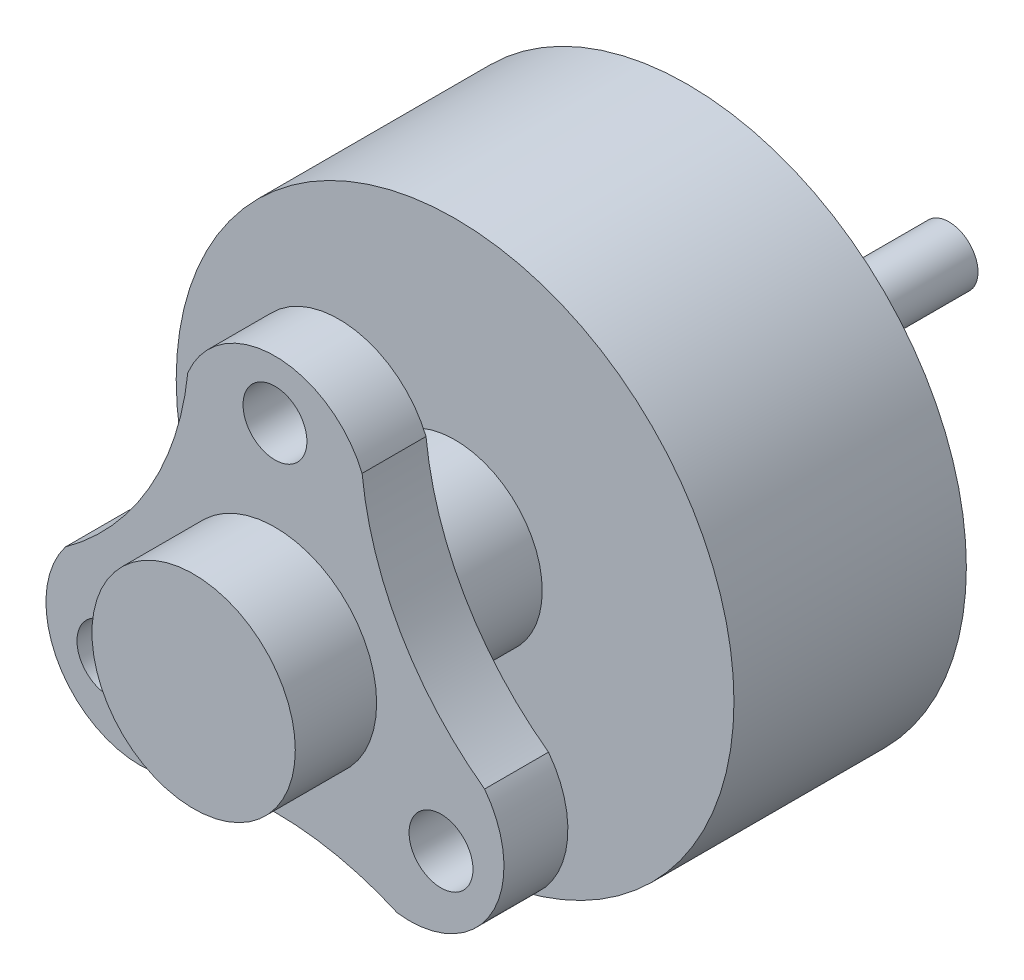
ISO-10303-21;
HEADER;
FILE_DESCRIPTION(('STEP AP214'),'2;1');
FILE_NAME('part.step','',(''),(''),'','','');
FILE_SCHEMA(('AUTOMOTIVE_DESIGN { 1 0 10303 214 1 1 1 1 }'));
ENDSEC;
DATA;
#1=APPLICATION_CONTEXT('core data for automotive mechanical design processes');
#2=APPLICATION_PROTOCOL_DEFINITION('international standard','automotive_design',2000,#1);
#3=PRODUCT_CONTEXT('',#1,'mechanical');
#4=PRODUCT('Part','Part','',(#3));
#5=PRODUCT_RELATED_PRODUCT_CATEGORY('part','',(#4));
#6=PRODUCT_DEFINITION_FORMATION('','',#4);
#7=PRODUCT_DEFINITION_CONTEXT('part definition',#1,'design');
#8=PRODUCT_DEFINITION('design','',#6,#7);
#9=PRODUCT_DEFINITION_SHAPE('','',#8);
#10=(LENGTH_UNIT() NAMED_UNIT(*) SI_UNIT(.MILLI.,.METRE.));
#11=(NAMED_UNIT(*) PLANE_ANGLE_UNIT() SI_UNIT($,.RADIAN.));
#12=(NAMED_UNIT(*) SI_UNIT($,.STERADIAN.) SOLID_ANGLE_UNIT());
#13=UNCERTAINTY_MEASURE_WITH_UNIT(LENGTH_MEASURE(1.E-05),#10,'distance_accuracy_value','');
#14=(GEOMETRIC_REPRESENTATION_CONTEXT(3) GLOBAL_UNCERTAINTY_ASSIGNED_CONTEXT((#13)) GLOBAL_UNIT_ASSIGNED_CONTEXT((#10,
#11,#12)) REPRESENTATION_CONTEXT('',''));
#15=CARTESIAN_POINT('',(0.,0.,0.));
#16=DIRECTION('',(0.,0.,1.));
#17=DIRECTION('',(1.,0.,0.));
#18=AXIS2_PLACEMENT_3D('',#15,#16,#17);
#19=CARTESIAN_POINT('',(0.,0.,4.));
#20=DIRECTION('',(0.,0.,-1.));
#21=DIRECTION('',(-1.,0.,0.));
#22=AXIS2_PLACEMENT_3D('',#19,#20,#21);
#23=CYLINDRICAL_SURFACE('',#22,4.8);
#24=CARTESIAN_POINT('',(0.,0.,4.));
#25=DIRECTION('',(0.,0.,1.));
#26=DIRECTION('',(1.,0.,0.));
#27=AXIS2_PLACEMENT_3D('',#24,#25,#26);
#28=CIRCLE('',#27,4.8);
#29=CARTESIAN_POINT('',(4.8,0.,4.));
#30=VERTEX_POINT('',#29);
#31=EDGE_CURVE('E174',#30,#30,#28,.T.);
#32=ORIENTED_EDGE('',*,*,#31,.F.);
#33=EDGE_LOOP('',(#32));
#34=FACE_BOUND('',#33,.T.);
#35=CARTESIAN_POINT('',(0.,0.,0.));
#36=DIRECTION('',(0.,0.,1.));
#37=DIRECTION('',(1.,0.,0.));
#38=AXIS2_PLACEMENT_3D('',#35,#36,#37);
#39=CIRCLE('',#38,4.8);
#40=CARTESIAN_POINT('',(4.8,0.,0.));
#41=VERTEX_POINT('',#40);
#42=EDGE_CURVE('E170',#41,#41,#39,.T.);
#43=ORIENTED_EDGE('',*,*,#42,.T.);
#44=EDGE_LOOP('',(#43));
#45=FACE_BOUND('',#44,.T.);
#46=ADVANCED_FACE('F45',(#34,#45),#23,.T.);
#47=CARTESIAN_POINT('',(0.,0.,4.));
#48=DIRECTION('',(0.,0.,1.));
#49=DIRECTION('',(1.,0.,0.));
#50=AXIS2_PLACEMENT_3D('',#47,#48,#49);
#51=PLANE('',#50);
#52=CARTESIAN_POINT('',(0.,0.,4.));
#53=DIRECTION('',(0.,0.,1.));
#54=DIRECTION('',(1.,0.,0.));
#55=AXIS2_PLACEMENT_3D('',#52,#53,#54);
#56=CIRCLE('',#55,1.5);
#57=CARTESIAN_POINT('',(1.5,0.,4.));
#58=VERTEX_POINT('',#57);
#59=EDGE_CURVE('E54',#58,#58,#56,.T.);
#60=ORIENTED_EDGE('',*,*,#59,.F.);
#61=EDGE_LOOP('',(#60));
#62=FACE_BOUND('',#61,.T.);
#63=ORIENTED_EDGE('',*,*,#31,.T.);
#64=EDGE_LOOP('',(#63));
#65=FACE_BOUND('',#64,.T.);
#66=ADVANCED_FACE('F185',(#62,#65),#51,.T.);
#67=CARTESIAN_POINT('',(0.,0.,0.));
#68=DIRECTION('',(0.,0.,1.));
#69=DIRECTION('',(1.,0.,0.));
#70=AXIS2_PLACEMENT_3D('',#67,#68,#69);
#71=PLANE('',#70);
#72=CARTESIAN_POINT('',(0.,0.,0.));
#73=DIRECTION('',(0.,0.,1.));
#74=DIRECTION('',(1.,0.,0.));
#75=AXIS2_PLACEMENT_3D('',#72,#73,#74);
#76=CIRCLE('',#75,0.5);
#77=CARTESIAN_POINT('',(0.5,0.,0.));
#78=VERTEX_POINT('',#77);
#79=EDGE_CURVE('E11',#78,#78,#76,.F.);
#80=ORIENTED_EDGE('',*,*,#79,.F.);
#81=EDGE_LOOP('',(#80));
#82=FACE_BOUND('',#81,.T.);
#83=ORIENTED_EDGE('',*,*,#42,.F.);
#84=EDGE_LOOP('',(#83));
#85=FACE_BOUND('',#84,.T.);
#86=ADVANCED_FACE('F182',(#82,#85),#71,.F.);
#87=CARTESIAN_POINT('',(0.,0.,6.));
#88=DIRECTION('',(0.,0.,-1.));
#89=DIRECTION('',(-1.,0.,0.));
#90=AXIS2_PLACEMENT_3D('',#87,#88,#89);
#91=CYLINDRICAL_SURFACE('',#90,1.5);
#92=CARTESIAN_POINT('',(0.,0.,6.));
#93=DIRECTION('',(0.,0.,1.));
#94=DIRECTION('',(1.,0.,0.));
#95=AXIS2_PLACEMENT_3D('',#92,#93,#94);
#96=CIRCLE('',#95,1.5);
#97=CARTESIAN_POINT('',(1.5,0.,6.));
#98=VERTEX_POINT('',#97);
#99=EDGE_CURVE('E166',#98,#98,#96,.T.);
#100=ORIENTED_EDGE('',*,*,#99,.F.);
#101=EDGE_LOOP('',(#100));
#102=FACE_BOUND('',#101,.T.);
#103=ORIENTED_EDGE('',*,*,#59,.T.);
#104=EDGE_LOOP('',(#103));
#105=FACE_BOUND('',#104,.T.);
#106=ADVANCED_FACE('F184',(#102,#105),#91,.T.);
#107=CARTESIAN_POINT('',(-2.31661795512337,-1.33750000000001,7.1));
#108=DIRECTION('',(0.,0.,-1.));
#109=DIRECTION('',(-1.,0.,0.));
#110=AXIS2_PLACEMENT_3D('',#107,#108,#109);
#111=CYLINDRICAL_SURFACE('',#110,1.625);
#112=CARTESIAN_POINT('',(-2.31661795512337,-1.33750000000001,6.));
#113=DIRECTION('',(0.,0.,1.));
#114=DIRECTION('',(1.,0.,0.));
#115=AXIS2_PLACEMENT_3D('',#112,#113,#114);
#116=CIRCLE('',#115,1.625);
#117=CARTESIAN_POINT('',(-3.60788383248865,-0.35096189432336,6.));
#118=VERTEX_POINT('',#117);
#119=CARTESIAN_POINT('',(-2.10788383248863,-2.94903810567667,6.));
#120=VERTEX_POINT('',#119);
#121=EDGE_CURVE('E133',#118,#120,#116,.T.);
#122=ORIENTED_EDGE('',*,*,#121,.T.);
#123=DIRECTION('',(0.,0.,-1.));
#124=VECTOR('',#123,1.);
#125=CARTESIAN_POINT('',(-2.10788383248863,-2.94903810567667,7.1));
#126=LINE('',#125,#124);
#127=CARTESIAN_POINT('',(-2.10788383248863,-2.94903810567667,7.1));
#128=VERTEX_POINT('',#127);
#129=EDGE_CURVE('E163',#128,#120,#126,.T.);
#130=ORIENTED_EDGE('',*,*,#129,.F.);
#131=CARTESIAN_POINT('',(-2.31661795512337,-1.33750000000001,7.1));
#132=DIRECTION('',(0.,0.,1.));
#133=DIRECTION('',(1.,0.,0.));
#134=AXIS2_PLACEMENT_3D('',#131,#132,#133);
#135=CIRCLE('',#134,1.625);
#136=CARTESIAN_POINT('',(-3.60788383248865,-0.35096189432336,7.1));
#137=VERTEX_POINT('',#136);
#138=EDGE_CURVE('E153',#137,#128,#135,.T.);
#139=ORIENTED_EDGE('',*,*,#138,.F.);
#140=DIRECTION('',(0.,0.,-1.));
#141=VECTOR('',#140,1.);
#142=CARTESIAN_POINT('',(-3.60788383248865,-0.35096189432336,7.1));
#143=LINE('',#142,#141);
#144=EDGE_CURVE('E129',#137,#118,#143,.T.);
#145=ORIENTED_EDGE('',*,*,#144,.T.);
#146=EDGE_LOOP('',(#122,#130,#139,#145));
#147=FACE_BOUND('',#146,.T.);
#148=ADVANCED_FACE('F191',(#147),#111,.T.);
#149=CARTESIAN_POINT('',(0.,-7.67195468814085,7.1));
#150=DIRECTION('',(0.,0.,-1.));
#151=DIRECTION('',(-1.,0.,0.));
#152=AXIS2_PLACEMENT_3D('',#149,#150,#151);
#153=CYLINDRICAL_SURFACE('',#152,5.17195468814085);
#154=CARTESIAN_POINT('',(0.,-7.67195468814085,6.));
#155=DIRECTION('',(0.,0.,1.));
#156=DIRECTION('',(1.,0.,0.));
#157=AXIS2_PLACEMENT_3D('',#154,#155,#156);
#158=CIRCLE('',#157,5.17195468814085);
#159=CARTESIAN_POINT('',(2.10788383248864,-2.94903810567667,6.));
#160=VERTEX_POINT('',#159);
#161=EDGE_CURVE('E137',#120,#160,#158,.F.);
#162=ORIENTED_EDGE('',*,*,#161,.T.);
#163=DIRECTION('',(0.,0.,-1.));
#164=VECTOR('',#163,1.);
#165=CARTESIAN_POINT('',(2.10788383248864,-2.94903810567667,7.1));
#166=LINE('',#165,#164);
#167=CARTESIAN_POINT('',(2.10788383248864,-2.94903810567667,7.1));
#168=VERTEX_POINT('',#167);
#169=EDGE_CURVE('E160',#168,#160,#166,.T.);
#170=ORIENTED_EDGE('',*,*,#169,.F.);
#171=CARTESIAN_POINT('',(0.,-7.67195468814085,7.1));
#172=DIRECTION('',(0.,0.,1.));
#173=DIRECTION('',(1.,0.,0.));
#174=AXIS2_PLACEMENT_3D('',#171,#172,#173);
#175=CIRCLE('',#174,5.17195468814085);
#176=EDGE_CURVE('E96',#128,#168,#175,.F.);
#177=ORIENTED_EDGE('',*,*,#176,.F.);
#178=ORIENTED_EDGE('',*,*,#129,.T.);
#179=EDGE_LOOP('',(#162,#170,#177,#178));
#180=FACE_BOUND('',#179,.T.);
#181=ADVANCED_FACE('F225',(#180),#153,.F.);
#182=CARTESIAN_POINT('',(2.31661795512337,-1.33750000000001,7.1));
#183=DIRECTION('',(0.,0.,-1.));
#184=DIRECTION('',(-1.,0.,0.));
#185=AXIS2_PLACEMENT_3D('',#182,#183,#184);
#186=CYLINDRICAL_SURFACE('',#185,1.625);
#187=CARTESIAN_POINT('',(2.31661795512337,-1.33750000000001,6.));
#188=DIRECTION('',(0.,0.,1.));
#189=DIRECTION('',(1.,0.,0.));
#190=AXIS2_PLACEMENT_3D('',#187,#188,#189);
#191=CIRCLE('',#190,1.625);
#192=CARTESIAN_POINT('',(3.60788383248865,-0.350961894323359,6.));
#193=VERTEX_POINT('',#192);
#194=EDGE_CURVE('E142',#193,#160,#191,.F.);
#195=ORIENTED_EDGE('',*,*,#194,.F.);
#196=DIRECTION('',(0.,0.,-1.));
#197=VECTOR('',#196,1.);
#198=CARTESIAN_POINT('',(3.60788383248865,-0.350961894323359,7.1));
#199=LINE('',#198,#197);
#200=CARTESIAN_POINT('',(3.60788383248865,-0.350961894323359,7.1));
#201=VERTEX_POINT('',#200);
#202=EDGE_CURVE('E116',#201,#193,#199,.T.);
#203=ORIENTED_EDGE('',*,*,#202,.F.);
#204=CARTESIAN_POINT('',(2.31661795512337,-1.33750000000001,7.1));
#205=DIRECTION('',(0.,0.,1.));
#206=DIRECTION('',(1.,0.,0.));
#207=AXIS2_PLACEMENT_3D('',#204,#205,#206);
#208=CIRCLE('',#207,1.625);
#209=EDGE_CURVE('E122',#201,#168,#208,.F.);
#210=ORIENTED_EDGE('',*,*,#209,.T.);
#211=ORIENTED_EDGE('',*,*,#169,.T.);
#212=EDGE_LOOP('',(#195,#203,#210,#211));
#213=FACE_BOUND('',#212,.T.);
#214=ADVANCED_FACE('F236',(#213),#186,.T.);
#215=CARTESIAN_POINT('',(6.64410765661333,3.83597734407054,7.1));
#216=DIRECTION('',(0.,0.,-1.));
#217=DIRECTION('',(-1.,0.,0.));
#218=AXIS2_PLACEMENT_3D('',#215,#216,#217);
#219=CYLINDRICAL_SURFACE('',#218,5.17195468814111);
#220=CARTESIAN_POINT('',(6.64410765661333,3.83597734407054,6.));
#221=DIRECTION('',(0.,0.,1.));
#222=DIRECTION('',(1.,0.,0.));
#223=AXIS2_PLACEMENT_3D('',#220,#221,#222);
#224=CIRCLE('',#223,5.17195468814111);
#225=CARTESIAN_POINT('',(1.5,3.3,6.));
#226=VERTEX_POINT('',#225);
#227=EDGE_CURVE('E110',#226,#193,#224,.T.);
#228=ORIENTED_EDGE('',*,*,#227,.F.);
#229=DIRECTION('',(0.,0.,-1.));
#230=VECTOR('',#229,1.);
#231=CARTESIAN_POINT('',(1.5,3.3,7.1));
#232=LINE('',#231,#230);
#233=CARTESIAN_POINT('',(1.5,3.3,7.1));
#234=VERTEX_POINT('',#233);
#235=EDGE_CURVE('E105',#234,#226,#232,.T.);
#236=ORIENTED_EDGE('',*,*,#235,.F.);
#237=CARTESIAN_POINT('',(6.64410765661333,3.83597734407054,7.1));
#238=DIRECTION('',(0.,0.,1.));
#239=DIRECTION('',(1.,0.,0.));
#240=AXIS2_PLACEMENT_3D('',#237,#238,#239);
#241=CIRCLE('',#240,5.17195468814111);
#242=EDGE_CURVE('E108',#234,#201,#241,.T.);
#243=ORIENTED_EDGE('',*,*,#242,.T.);
#244=ORIENTED_EDGE('',*,*,#202,.T.);
#245=EDGE_LOOP('',(#228,#236,#243,#244));
#246=FACE_BOUND('',#245,.T.);
#247=ADVANCED_FACE('F107',(#246),#219,.F.);
#248=CARTESIAN_POINT('',(0.,2.675,7.1));
#249=DIRECTION('',(0.,0.,-1.));
#250=DIRECTION('',(-1.,0.,0.));
#251=AXIS2_PLACEMENT_3D('',#248,#249,#250);
#252=CYLINDRICAL_SURFACE('',#251,1.625);
#253=CARTESIAN_POINT('',(0.,2.675,6.));
#254=DIRECTION('',(0.,0.,1.));
#255=DIRECTION('',(1.,0.,0.));
#256=AXIS2_PLACEMENT_3D('',#253,#254,#255);
#257=CIRCLE('',#256,1.625);
#258=CARTESIAN_POINT('',(-1.5,3.3,6.));
#259=VERTEX_POINT('',#258);
#260=EDGE_CURVE('E148',#259,#226,#257,.F.);
#261=ORIENTED_EDGE('',*,*,#260,.F.);
#262=DIRECTION('',(0.,0.,-1.));
#263=VECTOR('',#262,1.);
#264=CARTESIAN_POINT('',(-1.5,3.3,7.1));
#265=LINE('',#264,#263);
#266=CARTESIAN_POINT('',(-1.5,3.3,7.1));
#267=VERTEX_POINT('',#266);
#268=EDGE_CURVE('E84',#267,#259,#265,.T.);
#269=ORIENTED_EDGE('',*,*,#268,.F.);
#270=CARTESIAN_POINT('',(0.,2.675,7.1));
#271=DIRECTION('',(0.,0.,1.));
#272=DIRECTION('',(1.,0.,0.));
#273=AXIS2_PLACEMENT_3D('',#270,#271,#272);
#274=CIRCLE('',#273,1.625);
#275=EDGE_CURVE('E120',#267,#234,#274,.F.);
#276=ORIENTED_EDGE('',*,*,#275,.T.);
#277=ORIENTED_EDGE('',*,*,#235,.T.);
#278=EDGE_LOOP('',(#261,#269,#276,#277));
#279=FACE_BOUND('',#278,.T.);
#280=ADVANCED_FACE('F125',(#279),#252,.T.);
#281=CARTESIAN_POINT('',(-6.64410765661333,3.83597734407054,7.1));
#282=DIRECTION('',(0.,0.,-1.));
#283=DIRECTION('',(-1.,0.,0.));
#284=AXIS2_PLACEMENT_3D('',#281,#282,#283);
#285=CYLINDRICAL_SURFACE('',#284,5.17195468814111);
#286=CARTESIAN_POINT('',(-6.64410765661333,3.83597734407054,6.));
#287=DIRECTION('',(0.,0.,1.));
#288=DIRECTION('',(1.,0.,0.));
#289=AXIS2_PLACEMENT_3D('',#286,#287,#288);
#290=CIRCLE('',#289,5.17195468814111);
#291=EDGE_CURVE('E87',#259,#118,#290,.F.);
#292=ORIENTED_EDGE('',*,*,#291,.T.);
#293=ORIENTED_EDGE('',*,*,#144,.F.);
#294=CARTESIAN_POINT('',(-6.64410765661333,3.83597734407054,7.1));
#295=DIRECTION('',(0.,0.,1.));
#296=DIRECTION('',(1.,0.,0.));
#297=AXIS2_PLACEMENT_3D('',#294,#295,#296);
#298=CIRCLE('',#297,5.17195468814111);
#299=EDGE_CURVE('E62',#267,#137,#298,.F.);
#300=ORIENTED_EDGE('',*,*,#299,.F.);
#301=ORIENTED_EDGE('',*,*,#268,.T.);
#302=EDGE_LOOP('',(#292,#293,#300,#301));
#303=FACE_BOUND('',#302,.T.);
#304=ADVANCED_FACE('F265',(#303),#285,.F.);
#305=CARTESIAN_POINT('',(0.,0.,7.1));
#306=DIRECTION('',(0.,0.,1.));
#307=DIRECTION('',(1.,0.,0.));
#308=AXIS2_PLACEMENT_3D('',#305,#306,#307);
#309=PLANE('',#308);
#310=CARTESIAN_POINT('',(0.,0.,7.1));
#311=DIRECTION('',(0.,0.,1.));
#312=DIRECTION('',(1.,0.,0.));
#313=AXIS2_PLACEMENT_3D('',#310,#311,#312);
#314=CIRCLE('',#313,1.75);
#315=CARTESIAN_POINT('',(1.75,0.,7.1));
#316=VERTEX_POINT('',#315);
#317=EDGE_CURVE('E474',#316,#316,#314,.T.);
#318=ORIENTED_EDGE('',*,*,#317,.F.);
#319=EDGE_LOOP('',(#318));
#320=FACE_BOUND('',#319,.T.);
#321=CARTESIAN_POINT('',(2.85788415590999,-1.64999984120291,7.1));
#322=DIRECTION('',(0.,0.,1.));
#323=DIRECTION('',(1.,0.,0.));
#324=AXIS2_PLACEMENT_3D('',#321,#322,#323);
#325=CIRCLE('',#324,0.549999999999988);
#326=CARTESIAN_POINT('',(3.40788415590997,-1.64999984120291,7.1));
#327=VERTEX_POINT('',#326);
#328=EDGE_CURVE('E479',#327,#327,#325,.T.);
#329=ORIENTED_EDGE('',*,*,#328,.F.);
#330=EDGE_LOOP('',(#329));
#331=FACE_BOUND('',#330,.T.);
#332=CARTESIAN_POINT('',(-2.85788391023536,-1.64999984120291,7.1));
#333=DIRECTION('',(0.,0.,1.));
#334=DIRECTION('',(1.,0.,0.));
#335=AXIS2_PLACEMENT_3D('',#332,#333,#334);
#336=CIRCLE('',#335,0.549999999999988);
#337=CARTESIAN_POINT('',(-2.30788391023537,-1.64999984120291,7.1));
#338=VERTEX_POINT('',#337);
#339=EDGE_CURVE('E491',#338,#338,#336,.T.);
#340=ORIENTED_EDGE('',*,*,#339,.F.);
#341=EDGE_LOOP('',(#340));
#342=FACE_BOUND('',#341,.T.);
#343=CARTESIAN_POINT('',(0.,3.30000022768105,7.1));
#344=DIRECTION('',(0.,0.,1.));
#345=DIRECTION('',(1.,0.,0.));
#346=AXIS2_PLACEMENT_3D('',#343,#344,#345);
#347=CIRCLE('',#346,0.549999999999988);
#348=CARTESIAN_POINT('',(0.549999999999988,3.30000022768105,7.1));
#349=VERTEX_POINT('',#348);
#350=EDGE_CURVE('E499',#349,#349,#347,.T.);
#351=ORIENTED_EDGE('',*,*,#350,.F.);
#352=EDGE_LOOP('',(#351));
#353=FACE_BOUND('',#352,.T.);
#354=ORIENTED_EDGE('',*,*,#138,.T.);
#355=ORIENTED_EDGE('',*,*,#176,.T.);
#356=ORIENTED_EDGE('',*,*,#209,.F.);
#357=ORIENTED_EDGE('',*,*,#242,.F.);
#358=ORIENTED_EDGE('',*,*,#275,.F.);
#359=ORIENTED_EDGE('',*,*,#299,.T.);
#360=EDGE_LOOP('',(#354,#355,#356,#357,#358,#359));
#361=FACE_BOUND('',#360,.T.);
#362=ADVANCED_FACE('F119',(#320,#331,#342,#353,#361),#309,.T.);
#363=CARTESIAN_POINT('',(0.,0.,6.));
#364=DIRECTION('',(0.,0.,1.));
#365=DIRECTION('',(1.,0.,0.));
#366=AXIS2_PLACEMENT_3D('',#363,#364,#365);
#367=PLANE('',#366);
#368=CARTESIAN_POINT('',(2.85788415590999,-1.64999984120291,6.));
#369=DIRECTION('',(0.,0.,1.));
#370=DIRECTION('',(1.,0.,0.));
#371=AXIS2_PLACEMENT_3D('',#368,#369,#370);
#372=CIRCLE('',#371,0.549999999999994);
#373=CARTESIAN_POINT('',(3.40788415590998,-1.64999984120291,6.));
#374=VERTEX_POINT('',#373);
#375=EDGE_CURVE('E487',#374,#374,#372,.T.);
#376=ORIENTED_EDGE('',*,*,#375,.T.);
#377=EDGE_LOOP('',(#376));
#378=FACE_BOUND('',#377,.T.);
#379=CARTESIAN_POINT('',(-2.85788391023536,-1.64999984120291,6.));
#380=DIRECTION('',(0.,0.,1.));
#381=DIRECTION('',(1.,0.,0.));
#382=AXIS2_PLACEMENT_3D('',#379,#380,#381);
#383=CIRCLE('',#382,0.549999999999994);
#384=CARTESIAN_POINT('',(-2.30788391023537,-1.64999984120291,6.));
#385=VERTEX_POINT('',#384);
#386=EDGE_CURVE('E495',#385,#385,#383,.T.);
#387=ORIENTED_EDGE('',*,*,#386,.T.);
#388=EDGE_LOOP('',(#387));
#389=FACE_BOUND('',#388,.T.);
#390=CARTESIAN_POINT('',(0.,3.30000022768105,6.));
#391=DIRECTION('',(0.,0.,1.));
#392=DIRECTION('',(1.,0.,0.));
#393=AXIS2_PLACEMENT_3D('',#390,#391,#392);
#394=CIRCLE('',#393,0.549999999999994);
#395=CARTESIAN_POINT('',(0.549999999999994,3.30000022768105,6.));
#396=VERTEX_POINT('',#395);
#397=EDGE_CURVE('E138',#396,#396,#394,.T.);
#398=ORIENTED_EDGE('',*,*,#397,.T.);
#399=EDGE_LOOP('',(#398));
#400=FACE_BOUND('',#399,.T.);
#401=ORIENTED_EDGE('',*,*,#99,.T.);
#402=EDGE_LOOP('',(#401));
#403=FACE_BOUND('',#402,.T.);
#404=ORIENTED_EDGE('',*,*,#121,.F.);
#405=ORIENTED_EDGE('',*,*,#291,.F.);
#406=ORIENTED_EDGE('',*,*,#260,.T.);
#407=ORIENTED_EDGE('',*,*,#227,.T.);
#408=ORIENTED_EDGE('',*,*,#194,.T.);
#409=ORIENTED_EDGE('',*,*,#161,.F.);
#410=EDGE_LOOP('',(#404,#405,#406,#407,#408,#409));
#411=FACE_BOUND('',#410,.T.);
#412=ADVANCED_FACE('F282',(#378,#389,#400,#403,#411),#367,.F.);
#413=CARTESIAN_POINT('',(0.,3.30000022768105,7.1));
#414=DIRECTION('',(0.,0.,1.));
#415=DIRECTION('',(1.,0.,0.));
#416=AXIS2_PLACEMENT_3D('',#413,#414,#415);
#417=CYLINDRICAL_SURFACE('',#416,0.549999999999994);
#418=ORIENTED_EDGE('',*,*,#397,.F.);
#419=EDGE_LOOP('',(#418));
#420=FACE_BOUND('',#419,.T.);
#421=ORIENTED_EDGE('',*,*,#350,.T.);
#422=EDGE_LOOP('',(#421));
#423=FACE_BOUND('',#422,.T.);
#424=ADVANCED_FACE('F287',(#420,#423),#417,.F.);
#425=CARTESIAN_POINT('',(-2.85788391023536,-1.64999984120291,7.1));
#426=DIRECTION('',(0.,0.,1.));
#427=DIRECTION('',(1.,0.,0.));
#428=AXIS2_PLACEMENT_3D('',#425,#426,#427);
#429=CYLINDRICAL_SURFACE('',#428,0.549999999999994);
#430=ORIENTED_EDGE('',*,*,#386,.F.);
#431=EDGE_LOOP('',(#430));
#432=FACE_BOUND('',#431,.T.);
#433=ORIENTED_EDGE('',*,*,#339,.T.);
#434=EDGE_LOOP('',(#433));
#435=FACE_BOUND('',#434,.T.);
#436=ADVANCED_FACE('F298',(#432,#435),#429,.F.);
#437=CARTESIAN_POINT('',(2.85788415590999,-1.64999984120291,7.1));
#438=DIRECTION('',(0.,0.,1.));
#439=DIRECTION('',(1.,0.,0.));
#440=AXIS2_PLACEMENT_3D('',#437,#438,#439);
#441=CYLINDRICAL_SURFACE('',#440,0.549999999999994);
#442=ORIENTED_EDGE('',*,*,#375,.F.);
#443=EDGE_LOOP('',(#442));
#444=FACE_BOUND('',#443,.T.);
#445=ORIENTED_EDGE('',*,*,#328,.T.);
#446=EDGE_LOOP('',(#445));
#447=FACE_BOUND('',#446,.T.);
#448=ADVANCED_FACE('F309',(#444,#447),#441,.F.);
#449=CARTESIAN_POINT('',(0.,0.,-4.5));
#450=DIRECTION('',(0.,0.,1.));
#451=DIRECTION('',(1.,0.,0.));
#452=AXIS2_PLACEMENT_3D('',#449,#450,#451);
#453=CYLINDRICAL_SURFACE('',#452,0.5);
#454=CARTESIAN_POINT('',(0.,0.,-4.5));
#455=DIRECTION('',(0.,0.,-1.));
#456=DIRECTION('',(-1.,0.,0.));
#457=AXIS2_PLACEMENT_3D('',#454,#455,#456);
#458=CIRCLE('',#457,0.5);
#459=CARTESIAN_POINT('',(-0.5,0.,-4.5));
#460=VERTEX_POINT('',#459);
#461=EDGE_CURVE('E473',#460,#460,#458,.T.);
#462=ORIENTED_EDGE('',*,*,#461,.F.);
#463=EDGE_LOOP('',(#462));
#464=FACE_BOUND('',#463,.T.);
#465=ORIENTED_EDGE('',*,*,#79,.T.);
#466=EDGE_LOOP('',(#465));
#467=FACE_BOUND('',#466,.T.);
#468=ADVANCED_FACE('F319',(#464,#467),#453,.T.);
#469=CARTESIAN_POINT('',(0.,0.,-4.5));
#470=DIRECTION('',(0.,0.,-1.));
#471=DIRECTION('',(-1.,0.,0.));
#472=AXIS2_PLACEMENT_3D('',#469,#470,#471);
#473=PLANE('',#472);
#474=ORIENTED_EDGE('',*,*,#461,.T.);
#475=EDGE_LOOP('',(#474));
#476=FACE_BOUND('',#475,.T.);
#477=ADVANCED_FACE('F335',(#476),#473,.T.);
#478=CARTESIAN_POINT('',(0.,0.,8.5));
#479=DIRECTION('',(0.,0.,-1.));
#480=DIRECTION('',(-1.,0.,0.));
#481=AXIS2_PLACEMENT_3D('',#478,#479,#480);
#482=CYLINDRICAL_SURFACE('',#481,1.75);
#483=CARTESIAN_POINT('',(0.,0.,8.5));
#484=DIRECTION('',(0.,0.,1.));
#485=DIRECTION('',(1.,0.,0.));
#486=AXIS2_PLACEMENT_3D('',#483,#484,#485);
#487=CIRCLE('',#486,1.75);
#488=CARTESIAN_POINT('',(1.75,0.,8.5));
#489=VERTEX_POINT('',#488);
#490=EDGE_CURVE('E471',#489,#489,#487,.T.);
#491=ORIENTED_EDGE('',*,*,#490,.F.);
#492=EDGE_LOOP('',(#491));
#493=FACE_BOUND('',#492,.T.);
#494=ORIENTED_EDGE('',*,*,#317,.T.);
#495=EDGE_LOOP('',(#494));
#496=FACE_BOUND('',#495,.T.);
#497=ADVANCED_FACE('F346',(#493,#496),#482,.T.);
#498=CARTESIAN_POINT('',(0.,0.,8.5));
#499=DIRECTION('',(0.,0.,1.));
#500=DIRECTION('',(1.,0.,0.));
#501=AXIS2_PLACEMENT_3D('',#498,#499,#500);
#502=PLANE('',#501);
#503=ORIENTED_EDGE('',*,*,#490,.T.);
#504=EDGE_LOOP('',(#503));
#505=FACE_BOUND('',#504,.T.);
#506=ADVANCED_FACE('F363',(#505),#502,.T.);
#507=CLOSED_SHELL('',(#46,#66,#86,#106,#148,#181,#214,#247,#280,#304,#362,#412,#424,#436,#448,
#468,#477,#497,#506));
#508=MANIFOLD_SOLID_BREP('B2',#507);
#509=ADVANCED_BREP_SHAPE_REPRESENTATION('',(#18,#508),#14);
#510=SHAPE_DEFINITION_REPRESENTATION(#9,#509);
ENDSEC;
END-ISO-10303-21;
